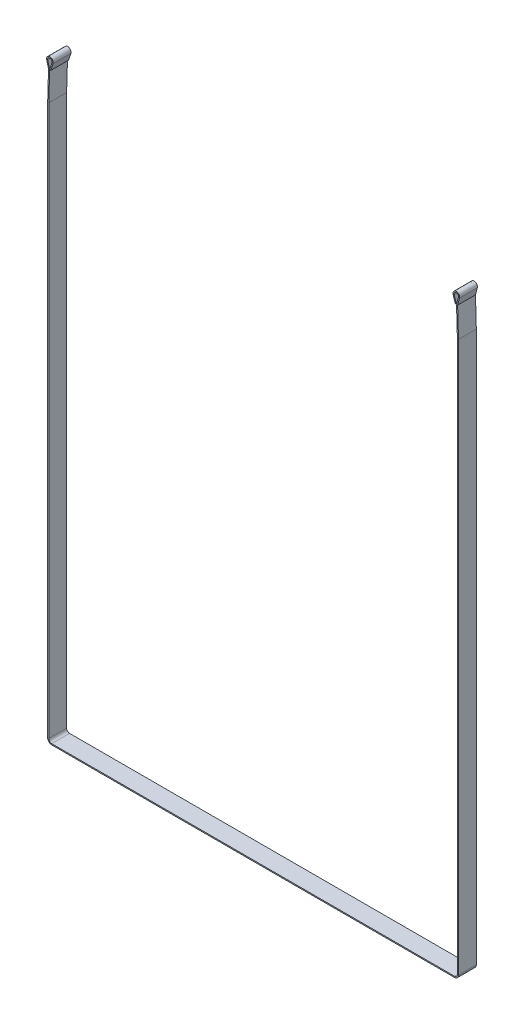
ISO-10303-21;
HEADER;
FILE_DESCRIPTION(('STEP AP214'),'2;1');
FILE_NAME('part.step','',(''),(''),'','','');
FILE_SCHEMA(('AUTOMOTIVE_DESIGN { 1 0 10303 214 1 1 1 1 }'));
ENDSEC;
DATA;
#1=APPLICATION_CONTEXT('core data for automotive mechanical design processes');
#2=APPLICATION_PROTOCOL_DEFINITION('international standard','automotive_design',2000,#1);
#3=PRODUCT_CONTEXT('',#1,'mechanical');
#4=PRODUCT('Part','Part','',(#3));
#5=PRODUCT_RELATED_PRODUCT_CATEGORY('part','',(#4));
#6=PRODUCT_DEFINITION_FORMATION('','',#4);
#7=PRODUCT_DEFINITION_CONTEXT('part definition',#1,'design');
#8=PRODUCT_DEFINITION('design','',#6,#7);
#9=PRODUCT_DEFINITION_SHAPE('','',#8);
#10=(LENGTH_UNIT() NAMED_UNIT(*) SI_UNIT(.MILLI.,.METRE.));
#11=(NAMED_UNIT(*) PLANE_ANGLE_UNIT() SI_UNIT($,.RADIAN.));
#12=(NAMED_UNIT(*) SI_UNIT($,.STERADIAN.) SOLID_ANGLE_UNIT());
#13=UNCERTAINTY_MEASURE_WITH_UNIT(LENGTH_MEASURE(1.E-05),#10,'distance_accuracy_value','');
#14=(GEOMETRIC_REPRESENTATION_CONTEXT(3) GLOBAL_UNCERTAINTY_ASSIGNED_CONTEXT((#13)) GLOBAL_UNIT_ASSIGNED_CONTEXT((#10,
#11,#12)) REPRESENTATION_CONTEXT('',''));
#15=CARTESIAN_POINT('',(0.,0.,0.));
#16=DIRECTION('',(0.,0.,1.));
#17=DIRECTION('',(1.,0.,0.));
#18=AXIS2_PLACEMENT_3D('',#15,#16,#17);
#19=CARTESIAN_POINT('',(538.452794867994,17.1812619079811,24.));
#20=DIRECTION('',(0.949689459111851,0.313193121335448,0.));
#21=DIRECTION('',(-0.313193121335448,0.949689459111851,0.));
#22=AXIS2_PLACEMENT_3D('',#19,#20,#21);
#23=PLANE('',#22);
#24=DIRECTION('',(0.313193121335448,-0.949689459111851,0.));
#25=VECTOR('',#24,1.);
#26=CARTESIAN_POINT('',(538.452794867994,17.1812619079811,-24.));
#27=LINE('',#26,#25);
#28=CARTESIAN_POINT('',(538.452794867994,17.1812619079811,-24.));
#29=VERTEX_POINT('',#28);
#30=CARTESIAN_POINT('',(544.716657294702,-1.81252727425592,-24.));
#31=VERTEX_POINT('',#30);
#32=EDGE_CURVE('E252',#29,#31,#27,.T.);
#33=ORIENTED_EDGE('',*,*,#32,.T.);
#34=DIRECTION('',(0.,0.,-1.));
#35=VECTOR('',#34,1.);
#36=CARTESIAN_POINT('',(544.716657294702,-1.81252727425592,24.));
#37=LINE('',#36,#35);
#38=CARTESIAN_POINT('',(544.716657294702,-1.81252727425592,24.));
#39=VERTEX_POINT('',#38);
#40=EDGE_CURVE('E11',#39,#31,#37,.T.);
#41=ORIENTED_EDGE('',*,*,#40,.F.);
#42=DIRECTION('',(0.313193121335448,-0.949689459111851,0.));
#43=VECTOR('',#42,1.);
#44=CARTESIAN_POINT('',(538.452794867994,17.1812619079811,24.));
#45=LINE('',#44,#43);
#46=CARTESIAN_POINT('',(538.452794867994,17.1812619079811,24.));
#47=VERTEX_POINT('',#46);
#48=EDGE_CURVE('E150',#47,#39,#45,.T.);
#49=ORIENTED_EDGE('',*,*,#48,.F.);
#50=DIRECTION('',(0.,0.,-1.));
#51=VECTOR('',#50,1.);
#52=CARTESIAN_POINT('',(538.452794867994,17.1812619079811,24.));
#53=LINE('',#52,#51);
#54=EDGE_CURVE('E248',#47,#29,#53,.T.);
#55=ORIENTED_EDGE('',*,*,#54,.T.);
#56=EDGE_LOOP('',(#33,#41,#49,#55));
#57=FACE_BOUND('',#56,.T.);
#58=ADVANCED_FACE('F36',(#57),#23,.F.);
#59=CARTESIAN_POINT('',(547.565725672038,-0.872947910249577,24.));
#60=DIRECTION('',(0.313193121335447,-0.949689459111851,0.));
#61=DIRECTION('',(0.949689459111851,0.313193121335447,0.));
#62=AXIS2_PLACEMENT_3D('',#59,#60,#61);
#63=PLANE('',#62);
#64=DIRECTION('',(-0.949689459111851,-0.313193121335447,0.));
#65=VECTOR('',#64,1.);
#66=CARTESIAN_POINT('',(547.565725672038,-0.872947910249577,-24.));
#67=LINE('',#66,#65);
#68=CARTESIAN_POINT('',(547.565725672038,-0.872947910249577,-24.));
#69=VERTEX_POINT('',#68);
#70=EDGE_CURVE('E255',#69,#31,#67,.T.);
#71=ORIENTED_EDGE('',*,*,#70,.F.);
#72=DIRECTION('',(0.,0.,-1.));
#73=VECTOR('',#72,1.);
#74=CARTESIAN_POINT('',(547.565725672038,-0.872947910249577,24.));
#75=LINE('',#74,#73);
#76=CARTESIAN_POINT('',(547.565725672038,-0.872947910249577,24.));
#77=VERTEX_POINT('',#76);
#78=EDGE_CURVE('E44',#77,#69,#75,.T.);
#79=ORIENTED_EDGE('',*,*,#78,.F.);
#80=DIRECTION('',(-0.949689459111851,-0.313193121335447,0.));
#81=VECTOR('',#80,1.);
#82=CARTESIAN_POINT('',(547.565725672038,-0.872947910249577,24.));
#83=LINE('',#82,#81);
#84=EDGE_CURVE('E396',#77,#39,#83,.T.);
#85=ORIENTED_EDGE('',*,*,#84,.T.);
#86=ORIENTED_EDGE('',*,*,#40,.T.);
#87=EDGE_LOOP('',(#71,#79,#85,#86));
#88=FACE_BOUND('',#87,.T.);
#89=ADVANCED_FACE('F386',(#88),#63,.T.);
#90=CARTESIAN_POINT('',(541.301863245329,18.1208412719874,24.));
#91=DIRECTION('',(0.949689459111851,0.313193121335448,0.));
#92=DIRECTION('',(-0.313193121335448,0.949689459111851,0.));
#93=AXIS2_PLACEMENT_3D('',#90,#91,#92);
#94=PLANE('',#93);
#95=DIRECTION('',(0.313193121335448,-0.949689459111851,0.));
#96=VECTOR('',#95,1.);
#97=CARTESIAN_POINT('',(541.301863245329,18.1208412719874,-24.));
#98=LINE('',#97,#96);
#99=CARTESIAN_POINT('',(541.301863245329,18.1208412719873,-24.));
#100=VERTEX_POINT('',#99);
#101=EDGE_CURVE('E258',#100,#69,#98,.T.);
#102=ORIENTED_EDGE('',*,*,#101,.F.);
#103=DIRECTION('',(0.,0.,-1.));
#104=VECTOR('',#103,1.);
#105=CARTESIAN_POINT('',(541.301863245329,18.1208412719873,24.));
#106=LINE('',#105,#104);
#107=CARTESIAN_POINT('',(541.301863245329,18.1208412719873,24.));
#108=VERTEX_POINT('',#107);
#109=EDGE_CURVE('E375',#108,#100,#106,.T.);
#110=ORIENTED_EDGE('',*,*,#109,.F.);
#111=DIRECTION('',(0.313193121335448,-0.949689459111851,0.));
#112=VECTOR('',#111,1.);
#113=CARTESIAN_POINT('',(541.301863245329,18.1208412719874,24.));
#114=LINE('',#113,#112);
#115=EDGE_CURVE('E383',#108,#77,#114,.T.);
#116=ORIENTED_EDGE('',*,*,#115,.T.);
#117=ORIENTED_EDGE('',*,*,#78,.T.);
#118=EDGE_LOOP('',(#102,#110,#116,#117));
#119=FACE_BOUND('',#118,.T.);
#120=ADVANCED_FACE('F381',(#119),#94,.T.);
#121=CARTESIAN_POINT('',(547.,20.0000000000002,24.));
#122=DIRECTION('',(0.,0.,-1.));
#123=DIRECTION('',(-1.,0.,0.));
#124=AXIS2_PLACEMENT_3D('',#121,#122,#123);
#125=CYLINDRICAL_SURFACE('',#124,6.00000000000006);
#126=CARTESIAN_POINT('',(547.,20.0000000000002,-24.));
#127=DIRECTION('',(0.,0.,1.));
#128=DIRECTION('',(1.,0.,0.));
#129=AXIS2_PLACEMENT_3D('',#126,#127,#128);
#130=CIRCLE('',#129,6.00000000000006);
#131=CARTESIAN_POINT('',(552.799001065501,18.4600043369173,-24.));
#132=VERTEX_POINT('',#131);
#133=EDGE_CURVE('E261',#132,#100,#130,.T.);
#134=ORIENTED_EDGE('',*,*,#133,.F.);
#135=DIRECTION('',(0.,0.,-1.));
#136=VECTOR('',#135,1.);
#137=CARTESIAN_POINT('',(552.799001065501,18.4600043369173,24.));
#138=LINE('',#137,#136);
#139=CARTESIAN_POINT('',(552.799001065501,18.4600043369173,24.));
#140=VERTEX_POINT('',#139);
#141=EDGE_CURVE('E373',#140,#132,#138,.T.);
#142=ORIENTED_EDGE('',*,*,#141,.F.);
#143=CARTESIAN_POINT('',(547.,20.0000000000002,24.));
#144=DIRECTION('',(0.,0.,1.));
#145=DIRECTION('',(-1.,0.,0.));
#146=AXIS2_PLACEMENT_3D('',#143,#144,#145);
#147=CIRCLE('',#146,5.99999999999987);
#148=EDGE_CURVE('E394',#140,#108,#147,.T.);
#149=ORIENTED_EDGE('',*,*,#148,.T.);
#150=ORIENTED_EDGE('',*,*,#109,.T.);
#151=EDGE_LOOP('',(#134,#142,#149,#150));
#152=FACE_BOUND('',#151,.T.);
#153=ADVANCED_FACE('F393',(#152),#125,.F.);
#154=CARTESIAN_POINT('',(552.799001065501,18.4600043369173,24.));
#155=DIRECTION('',(-0.966500177583562,0.25666594384714,0.));
#156=DIRECTION('',(-0.25666594384714,-0.966500177583562,0.));
#157=AXIS2_PLACEMENT_3D('',#154,#155,#156);
#158=PLANE('',#157);
#159=DIRECTION('',(0.25666594384714,0.966500177583562,0.));
#160=VECTOR('',#159,1.);
#161=CARTESIAN_POINT('',(552.799001065501,18.4600043369173,-24.));
#162=LINE('',#161,#160);
#163=CARTESIAN_POINT('',(547.665682188558,-0.869999214753968,-24.));
#164=VERTEX_POINT('',#163);
#165=EDGE_CURVE('E263',#164,#132,#162,.T.);
#166=ORIENTED_EDGE('',*,*,#165,.F.);
#167=DIRECTION('',(0.,0.,-1.));
#168=VECTOR('',#167,1.);
#169=CARTESIAN_POINT('',(547.665682188558,-0.869999214753968,24.));
#170=LINE('',#169,#168);
#171=CARTESIAN_POINT('',(547.665682188558,-0.869999214753968,24.));
#172=VERTEX_POINT('',#171);
#173=EDGE_CURVE('E371',#172,#164,#170,.T.);
#174=ORIENTED_EDGE('',*,*,#173,.F.);
#175=DIRECTION('',(0.25666594384714,0.966500177583562,0.));
#176=VECTOR('',#175,1.);
#177=CARTESIAN_POINT('',(552.799001065501,18.4600043369173,24.));
#178=LINE('',#177,#176);
#179=EDGE_CURVE('E398',#172,#140,#178,.T.);
#180=ORIENTED_EDGE('',*,*,#179,.T.);
#181=ORIENTED_EDGE('',*,*,#141,.T.);
#182=EDGE_LOOP('',(#166,#174,#180,#181));
#183=FACE_BOUND('',#182,.T.);
#184=ADVANCED_FACE('F476',(#183),#158,.T.);
#185=CARTESIAN_POINT('',(550.,-79.9999999999999,24.));
#186=DIRECTION('',(-0.999565165203058,-0.02948695495609,0.));
#187=DIRECTION('',(0.02948695495609,-0.999565165203059,0.));
#188=AXIS2_PLACEMENT_3D('',#185,#186,#187);
#189=PLANE('',#188);
#190=DIRECTION('',(-0.02948695495609,0.999565165203058,0.));
#191=VECTOR('',#190,1.);
#192=CARTESIAN_POINT('',(550.,-79.9999999999999,-24.));
#193=LINE('',#192,#191);
#194=CARTESIAN_POINT('',(550.,-79.9999999999999,-24.));
#195=VERTEX_POINT('',#194);
#196=EDGE_CURVE('E266',#195,#164,#193,.T.);
#197=ORIENTED_EDGE('',*,*,#196,.F.);
#198=DIRECTION('',(0.,0.,-1.));
#199=VECTOR('',#198,1.);
#200=CARTESIAN_POINT('',(550.,-79.9999999999999,24.));
#201=LINE('',#200,#199);
#202=CARTESIAN_POINT('',(550.,-79.9999999999999,24.));
#203=VERTEX_POINT('',#202);
#204=EDGE_CURVE('E369',#203,#195,#201,.T.);
#205=ORIENTED_EDGE('',*,*,#204,.F.);
#206=DIRECTION('',(-0.02948695495609,0.999565165203058,0.));
#207=VECTOR('',#206,1.);
#208=CARTESIAN_POINT('',(550.,-79.9999999999999,24.));
#209=LINE('',#208,#207);
#210=EDGE_CURVE('E405',#203,#172,#209,.T.);
#211=ORIENTED_EDGE('',*,*,#210,.T.);
#212=ORIENTED_EDGE('',*,*,#173,.T.);
#213=EDGE_LOOP('',(#197,#205,#211,#212));
#214=FACE_BOUND('',#213,.T.);
#215=ADVANCED_FACE('F479',(#214),#189,.T.);
#216=CARTESIAN_POINT('',(550.,-1562.,24.));
#217=DIRECTION('',(-1.,0.,0.));
#218=DIRECTION('',(0.,-1.,0.));
#219=AXIS2_PLACEMENT_3D('',#216,#217,#218);
#220=PLANE('',#219);
#221=DIRECTION('',(0.,1.,0.));
#222=VECTOR('',#221,1.);
#223=CARTESIAN_POINT('',(550.,-1562.,-24.));
#224=LINE('',#223,#222);
#225=CARTESIAN_POINT('',(550.,-1562.,-24.));
#226=VERTEX_POINT('',#225);
#227=EDGE_CURVE('E269',#226,#195,#224,.T.);
#228=ORIENTED_EDGE('',*,*,#227,.F.);
#229=DIRECTION('',(0.,0.,-1.));
#230=VECTOR('',#229,1.);
#231=CARTESIAN_POINT('',(550.,-1562.,24.));
#232=LINE('',#231,#230);
#233=CARTESIAN_POINT('',(550.,-1562.,24.));
#234=VERTEX_POINT('',#233);
#235=EDGE_CURVE('E367',#234,#226,#232,.T.);
#236=ORIENTED_EDGE('',*,*,#235,.F.);
#237=DIRECTION('',(0.,1.,0.));
#238=VECTOR('',#237,1.);
#239=CARTESIAN_POINT('',(550.,-1562.,24.));
#240=LINE('',#239,#238);
#241=EDGE_CURVE('E408',#234,#203,#240,.T.);
#242=ORIENTED_EDGE('',*,*,#241,.T.);
#243=ORIENTED_EDGE('',*,*,#204,.T.);
#244=EDGE_LOOP('',(#228,#236,#242,#243));
#245=FACE_BOUND('',#244,.T.);
#246=ADVANCED_FACE('F483',(#245),#220,.T.);
#247=CARTESIAN_POINT('',(542.,-1562.,24.));
#248=DIRECTION('',(0.,0.,-1.));
#249=DIRECTION('',(-1.,0.,0.));
#250=AXIS2_PLACEMENT_3D('',#247,#248,#249);
#251=CYLINDRICAL_SURFACE('',#250,7.9999999999999);
#252=CARTESIAN_POINT('',(542.,-1562.,-24.));
#253=DIRECTION('',(0.,0.,1.));
#254=DIRECTION('',(-1.,0.,0.));
#255=AXIS2_PLACEMENT_3D('',#252,#253,#254);
#256=CIRCLE('',#255,7.9999999999999);
#257=CARTESIAN_POINT('',(542.,-1570.,-24.));
#258=VERTEX_POINT('',#257);
#259=EDGE_CURVE('E272',#258,#226,#256,.T.);
#260=ORIENTED_EDGE('',*,*,#259,.F.);
#261=DIRECTION('',(0.,0.,-1.));
#262=VECTOR('',#261,1.);
#263=CARTESIAN_POINT('',(542.,-1570.,24.));
#264=LINE('',#263,#262);
#265=CARTESIAN_POINT('',(542.,-1570.,24.));
#266=VERTEX_POINT('',#265);
#267=EDGE_CURVE('E365',#266,#258,#264,.T.);
#268=ORIENTED_EDGE('',*,*,#267,.F.);
#269=CARTESIAN_POINT('',(542.,-1562.,24.));
#270=DIRECTION('',(0.,0.,1.));
#271=DIRECTION('',(-1.,0.,0.));
#272=AXIS2_PLACEMENT_3D('',#269,#270,#271);
#273=CIRCLE('',#272,7.9999999999999);
#274=EDGE_CURVE('E411',#266,#234,#273,.T.);
#275=ORIENTED_EDGE('',*,*,#274,.T.);
#276=ORIENTED_EDGE('',*,*,#235,.T.);
#277=EDGE_LOOP('',(#260,#268,#275,#276));
#278=FACE_BOUND('',#277,.T.);
#279=ADVANCED_FACE('F487',(#278),#251,.F.);
#280=CARTESIAN_POINT('',(542.,-1570.,24.));
#281=DIRECTION('',(0.,1.,0.));
#282=DIRECTION('',(-1.,0.,0.));
#283=AXIS2_PLACEMENT_3D('',#280,#281,#282);
#284=PLANE('',#283);
#285=DIRECTION('',(1.,0.,0.));
#286=VECTOR('',#285,1.);
#287=CARTESIAN_POINT('',(542.,-1570.,-24.));
#288=LINE('',#287,#286);
#289=CARTESIAN_POINT('',(-542.,-1570.,-24.));
#290=VERTEX_POINT('',#289);
#291=EDGE_CURVE('E275',#290,#258,#288,.T.);
#292=ORIENTED_EDGE('',*,*,#291,.F.);
#293=DIRECTION('',(0.,0.,-1.));
#294=VECTOR('',#293,1.);
#295=CARTESIAN_POINT('',(-542.,-1570.,24.));
#296=LINE('',#295,#294);
#297=CARTESIAN_POINT('',(-542.,-1570.,24.));
#298=VERTEX_POINT('',#297);
#299=EDGE_CURVE('E363',#298,#290,#296,.T.);
#300=ORIENTED_EDGE('',*,*,#299,.F.);
#301=DIRECTION('',(1.,0.,0.));
#302=VECTOR('',#301,1.);
#303=CARTESIAN_POINT('',(542.,-1570.,24.));
#304=LINE('',#303,#302);
#305=EDGE_CURVE('E414',#298,#266,#304,.T.);
#306=ORIENTED_EDGE('',*,*,#305,.T.);
#307=ORIENTED_EDGE('',*,*,#267,.T.);
#308=EDGE_LOOP('',(#292,#300,#306,#307));
#309=FACE_BOUND('',#308,.T.);
#310=ADVANCED_FACE('F491',(#309),#284,.T.);
#311=CARTESIAN_POINT('',(-542.,-1562.,24.));
#312=DIRECTION('',(0.,0.,-1.));
#313=DIRECTION('',(-1.,0.,0.));
#314=AXIS2_PLACEMENT_3D('',#311,#312,#313);
#315=CYLINDRICAL_SURFACE('',#314,7.9999999999999);
#316=CARTESIAN_POINT('',(-542.,-1562.,-24.));
#317=DIRECTION('',(0.,0.,1.));
#318=DIRECTION('',(1.,0.,0.));
#319=AXIS2_PLACEMENT_3D('',#316,#317,#318);
#320=CIRCLE('',#319,7.9999999999999);
#321=CARTESIAN_POINT('',(-550.,-1562.,-24.));
#322=VERTEX_POINT('',#321);
#323=EDGE_CURVE('E278',#322,#290,#320,.T.);
#324=ORIENTED_EDGE('',*,*,#323,.F.);
#325=DIRECTION('',(0.,0.,-1.));
#326=VECTOR('',#325,1.);
#327=CARTESIAN_POINT('',(-550.,-1562.,24.));
#328=LINE('',#327,#326);
#329=CARTESIAN_POINT('',(-550.,-1562.,24.));
#330=VERTEX_POINT('',#329);
#331=EDGE_CURVE('E361',#330,#322,#328,.T.);
#332=ORIENTED_EDGE('',*,*,#331,.F.);
#333=CARTESIAN_POINT('',(-542.,-1562.,24.));
#334=DIRECTION('',(0.,0.,1.));
#335=DIRECTION('',(1.,0.,0.));
#336=AXIS2_PLACEMENT_3D('',#333,#334,#335);
#337=CIRCLE('',#336,7.9999999999999);
#338=EDGE_CURVE('E417',#330,#298,#337,.T.);
#339=ORIENTED_EDGE('',*,*,#338,.T.);
#340=ORIENTED_EDGE('',*,*,#299,.T.);
#341=EDGE_LOOP('',(#324,#332,#339,#340));
#342=FACE_BOUND('',#341,.T.);
#343=ADVANCED_FACE('F495',(#342),#315,.F.);
#344=CARTESIAN_POINT('',(-550.,-1562.,24.));
#345=DIRECTION('',(1.,0.,0.));
#346=DIRECTION('',(0.,1.,0.));
#347=AXIS2_PLACEMENT_3D('',#344,#345,#346);
#348=PLANE('',#347);
#349=DIRECTION('',(0.,-1.,0.));
#350=VECTOR('',#349,1.);
#351=CARTESIAN_POINT('',(-550.,-1562.,-24.));
#352=LINE('',#351,#350);
#353=CARTESIAN_POINT('',(-550.,-80.,-24.));
#354=VERTEX_POINT('',#353);
#355=EDGE_CURVE('E281',#354,#322,#352,.T.);
#356=ORIENTED_EDGE('',*,*,#355,.F.);
#357=DIRECTION('',(0.,0.,-1.));
#358=VECTOR('',#357,1.);
#359=CARTESIAN_POINT('',(-550.,-80.,24.));
#360=LINE('',#359,#358);
#361=CARTESIAN_POINT('',(-550.,-80.,24.));
#362=VERTEX_POINT('',#361);
#363=EDGE_CURVE('E359',#362,#354,#360,.T.);
#364=ORIENTED_EDGE('',*,*,#363,.F.);
#365=DIRECTION('',(0.,-1.,0.));
#366=VECTOR('',#365,1.);
#367=CARTESIAN_POINT('',(-550.,-1562.,24.));
#368=LINE('',#367,#366);
#369=EDGE_CURVE('E420',#362,#330,#368,.T.);
#370=ORIENTED_EDGE('',*,*,#369,.T.);
#371=ORIENTED_EDGE('',*,*,#331,.T.);
#372=EDGE_LOOP('',(#356,#364,#370,#371));
#373=FACE_BOUND('',#372,.T.);
#374=ADVANCED_FACE('F499',(#373),#348,.T.);
#375=CARTESIAN_POINT('',(-550.,-80.,24.));
#376=DIRECTION('',(0.999565165203058,-0.02948695495609,0.));
#377=DIRECTION('',(0.02948695495609,0.999565165203059,0.));
#378=AXIS2_PLACEMENT_3D('',#375,#376,#377);
#379=PLANE('',#378);
#380=DIRECTION('',(-0.02948695495609,-0.999565165203058,0.));
#381=VECTOR('',#380,1.);
#382=CARTESIAN_POINT('',(-550.,-80.,-24.));
#383=LINE('',#382,#381);
#384=CARTESIAN_POINT('',(-547.665682188558,-0.869999214754103,-24.));
#385=VERTEX_POINT('',#384);
#386=EDGE_CURVE('E284',#385,#354,#383,.T.);
#387=ORIENTED_EDGE('',*,*,#386,.F.);
#388=DIRECTION('',(0.,0.,-1.));
#389=VECTOR('',#388,1.);
#390=CARTESIAN_POINT('',(-547.665682188558,-0.869999214754103,24.));
#391=LINE('',#390,#389);
#392=CARTESIAN_POINT('',(-547.665682188558,-0.869999214754103,24.));
#393=VERTEX_POINT('',#392);
#394=EDGE_CURVE('E357',#393,#385,#391,.T.);
#395=ORIENTED_EDGE('',*,*,#394,.F.);
#396=DIRECTION('',(-0.02948695495609,-0.999565165203058,0.));
#397=VECTOR('',#396,1.);
#398=CARTESIAN_POINT('',(-550.,-80.,24.));
#399=LINE('',#398,#397);
#400=EDGE_CURVE('E423',#393,#362,#399,.T.);
#401=ORIENTED_EDGE('',*,*,#400,.T.);
#402=ORIENTED_EDGE('',*,*,#363,.T.);
#403=EDGE_LOOP('',(#387,#395,#401,#402));
#404=FACE_BOUND('',#403,.T.);
#405=ADVANCED_FACE('F503',(#404),#379,.T.);
#406=CARTESIAN_POINT('',(-552.799001065501,18.4600043369171,24.));
#407=DIRECTION('',(0.966500177583562,0.25666594384714,0.));
#408=DIRECTION('',(-0.25666594384714,0.966500177583562,0.));
#409=AXIS2_PLACEMENT_3D('',#406,#407,#408);
#410=PLANE('',#409);
#411=DIRECTION('',(0.25666594384714,-0.966500177583562,0.));
#412=VECTOR('',#411,1.);
#413=CARTESIAN_POINT('',(-552.799001065501,18.4600043369171,-24.));
#414=LINE('',#413,#412);
#415=CARTESIAN_POINT('',(-552.799001065501,18.4600043369171,-24.));
#416=VERTEX_POINT('',#415);
#417=EDGE_CURVE('E287',#416,#385,#414,.T.);
#418=ORIENTED_EDGE('',*,*,#417,.F.);
#419=DIRECTION('',(0.,0.,-1.));
#420=VECTOR('',#419,1.);
#421=CARTESIAN_POINT('',(-552.799001065501,18.4600043369171,24.));
#422=LINE('',#421,#420);
#423=CARTESIAN_POINT('',(-552.799001065501,18.4600043369171,24.));
#424=VERTEX_POINT('',#423);
#425=EDGE_CURVE('E354',#424,#416,#422,.T.);
#426=ORIENTED_EDGE('',*,*,#425,.F.);
#427=DIRECTION('',(0.25666594384714,-0.966500177583562,0.));
#428=VECTOR('',#427,1.);
#429=CARTESIAN_POINT('',(-552.799001065501,18.4600043369171,24.));
#430=LINE('',#429,#428);
#431=EDGE_CURVE('E426',#424,#393,#430,.T.);
#432=ORIENTED_EDGE('',*,*,#431,.T.);
#433=ORIENTED_EDGE('',*,*,#394,.T.);
#434=EDGE_LOOP('',(#418,#426,#432,#433));
#435=FACE_BOUND('',#434,.T.);
#436=ADVANCED_FACE('F507',(#435),#410,.T.);
#437=CARTESIAN_POINT('',(-547.,20.,24.));
#438=DIRECTION('',(0.,0.,-1.));
#439=DIRECTION('',(-1.,0.,0.));
#440=AXIS2_PLACEMENT_3D('',#437,#438,#439);
#441=CYLINDRICAL_SURFACE('',#440,5.99999999999987);
#442=CARTESIAN_POINT('',(-547.,20.,-24.));
#443=DIRECTION('',(0.,0.,1.));
#444=DIRECTION('',(1.,0.,0.));
#445=AXIS2_PLACEMENT_3D('',#442,#443,#444);
#446=CIRCLE('',#445,5.99999999999987);
#447=CARTESIAN_POINT('',(-541.301863245329,18.1208412719873,-24.));
#448=VERTEX_POINT('',#447);
#449=EDGE_CURVE('E290',#448,#416,#446,.T.);
#450=ORIENTED_EDGE('',*,*,#449,.F.);
#451=DIRECTION('',(0.,0.,-1.));
#452=VECTOR('',#451,1.);
#453=CARTESIAN_POINT('',(-541.301863245329,18.1208412719873,24.));
#454=LINE('',#453,#452);
#455=CARTESIAN_POINT('',(-541.301863245329,18.1208412719873,24.));
#456=VERTEX_POINT('',#455);
#457=EDGE_CURVE('E352',#456,#448,#454,.T.);
#458=ORIENTED_EDGE('',*,*,#457,.F.);
#459=CARTESIAN_POINT('',(-547.,20.,24.));
#460=DIRECTION('',(0.,0.,1.));
#461=DIRECTION('',(-1.,0.,0.));
#462=AXIS2_PLACEMENT_3D('',#459,#460,#461);
#463=CIRCLE('',#462,6.00000000000006);
#464=EDGE_CURVE('E429',#456,#424,#463,.T.);
#465=ORIENTED_EDGE('',*,*,#464,.T.);
#466=ORIENTED_EDGE('',*,*,#425,.T.);
#467=EDGE_LOOP('',(#450,#458,#465,#466));
#468=FACE_BOUND('',#467,.T.);
#469=ADVANCED_FACE('F511',(#468),#441,.F.);
#470=CARTESIAN_POINT('',(-541.301863245329,18.1208412719873,24.));
#471=DIRECTION('',(-0.949689459111851,0.313193121335448,0.));
#472=DIRECTION('',(-0.313193121335448,-0.949689459111851,0.));
#473=AXIS2_PLACEMENT_3D('',#470,#471,#472);
#474=PLANE('',#473);
#475=DIRECTION('',(0.313193121335448,0.949689459111851,0.));
#476=VECTOR('',#475,1.);
#477=CARTESIAN_POINT('',(-541.301863245329,18.1208412719873,-24.));
#478=LINE('',#477,#476);
#479=CARTESIAN_POINT('',(-547.565725672038,-0.872947910249711,-24.));
#480=VERTEX_POINT('',#479);
#481=EDGE_CURVE('E292',#480,#448,#478,.T.);
#482=ORIENTED_EDGE('',*,*,#481,.F.);
#483=DIRECTION('',(0.,0.,-1.));
#484=VECTOR('',#483,1.);
#485=CARTESIAN_POINT('',(-547.565725672038,-0.872947910249711,24.));
#486=LINE('',#485,#484);
#487=CARTESIAN_POINT('',(-547.565725672038,-0.872947910249711,24.));
#488=VERTEX_POINT('',#487);
#489=EDGE_CURVE('E350',#488,#480,#486,.T.);
#490=ORIENTED_EDGE('',*,*,#489,.F.);
#491=DIRECTION('',(0.313193121335448,0.949689459111851,0.));
#492=VECTOR('',#491,1.);
#493=CARTESIAN_POINT('',(-541.301863245329,18.1208412719873,24.));
#494=LINE('',#493,#492);
#495=EDGE_CURVE('E432',#488,#456,#494,.T.);
#496=ORIENTED_EDGE('',*,*,#495,.T.);
#497=ORIENTED_EDGE('',*,*,#457,.T.);
#498=EDGE_LOOP('',(#482,#490,#496,#497));
#499=FACE_BOUND('',#498,.T.);
#500=ADVANCED_FACE('F515',(#499),#474,.T.);
#501=CARTESIAN_POINT('',(-544.716657294702,-1.81252727425606,24.));
#502=DIRECTION('',(-0.313193121335448,-0.949689459111851,0.));
#503=DIRECTION('',(0.949689459111851,-0.313193121335448,0.));
#504=AXIS2_PLACEMENT_3D('',#501,#502,#503);
#505=PLANE('',#504);
#506=DIRECTION('',(-0.949689459111851,0.313193121335448,0.));
#507=VECTOR('',#506,1.);
#508=CARTESIAN_POINT('',(-544.716657294702,-1.81252727425606,-24.));
#509=LINE('',#508,#507);
#510=CARTESIAN_POINT('',(-544.716657294702,-1.81252727425606,-24.));
#511=VERTEX_POINT('',#510);
#512=EDGE_CURVE('E295',#511,#480,#509,.T.);
#513=ORIENTED_EDGE('',*,*,#512,.F.);
#514=DIRECTION('',(0.,0.,-1.));
#515=VECTOR('',#514,1.);
#516=CARTESIAN_POINT('',(-544.716657294702,-1.81252727425606,24.));
#517=LINE('',#516,#515);
#518=CARTESIAN_POINT('',(-544.716657294702,-1.81252727425606,24.));
#519=VERTEX_POINT('',#518);
#520=EDGE_CURVE('E348',#519,#511,#517,.T.);
#521=ORIENTED_EDGE('',*,*,#520,.F.);
#522=DIRECTION('',(-0.949689459111851,0.313193121335448,0.));
#523=VECTOR('',#522,1.);
#524=CARTESIAN_POINT('',(-544.716657294702,-1.81252727425606,24.));
#525=LINE('',#524,#523);
#526=EDGE_CURVE('E435',#519,#488,#525,.T.);
#527=ORIENTED_EDGE('',*,*,#526,.T.);
#528=ORIENTED_EDGE('',*,*,#489,.T.);
#529=EDGE_LOOP('',(#513,#521,#527,#528));
#530=FACE_BOUND('',#529,.T.);
#531=ADVANCED_FACE('F519',(#530),#505,.T.);
#532=CARTESIAN_POINT('',(-538.452794867994,17.181261907981,24.));
#533=DIRECTION('',(-0.949689459111851,0.313193121335448,0.));
#534=DIRECTION('',(-0.313193121335448,-0.949689459111851,0.));
#535=AXIS2_PLACEMENT_3D('',#532,#533,#534);
#536=PLANE('',#535);
#537=DIRECTION('',(0.313193121335448,0.949689459111851,0.));
#538=VECTOR('',#537,1.);
#539=CARTESIAN_POINT('',(-538.452794867994,17.181261907981,-24.));
#540=LINE('',#539,#538);
#541=CARTESIAN_POINT('',(-538.452794867993,17.1812619079808,-24.));
#542=VERTEX_POINT('',#541);
#543=EDGE_CURVE('E298',#511,#542,#540,.T.);
#544=ORIENTED_EDGE('',*,*,#543,.T.);
#545=DIRECTION('',(0.,0.,-1.));
#546=VECTOR('',#545,1.);
#547=CARTESIAN_POINT('',(-538.452794867993,17.1812619079808,24.));
#548=LINE('',#547,#546);
#549=CARTESIAN_POINT('',(-538.452794867993,17.1812619079808,24.));
#550=VERTEX_POINT('',#549);
#551=EDGE_CURVE('E345',#550,#542,#548,.T.);
#552=ORIENTED_EDGE('',*,*,#551,.F.);
#553=DIRECTION('',(0.313193121335448,0.949689459111851,0.));
#554=VECTOR('',#553,1.);
#555=CARTESIAN_POINT('',(-538.452794867994,17.181261907981,24.));
#556=LINE('',#555,#554);
#557=EDGE_CURVE('E438',#519,#550,#556,.T.);
#558=ORIENTED_EDGE('',*,*,#557,.F.);
#559=ORIENTED_EDGE('',*,*,#520,.T.);
#560=EDGE_LOOP('',(#544,#552,#558,#559));
#561=FACE_BOUND('',#560,.T.);
#562=ADVANCED_FACE('F523',(#561),#536,.F.);
#563=CARTESIAN_POINT('',(-547.,20.,24.));
#564=DIRECTION('',(0.,0.,-1.));
#565=DIRECTION('',(-1.,0.,0.));
#566=AXIS2_PLACEMENT_3D('',#563,#564,#565);
#567=CYLINDRICAL_SURFACE('',#566,9.00000000000006);
#568=CARTESIAN_POINT('',(-547.,20.,-24.));
#569=DIRECTION('',(0.,0.,1.));
#570=DIRECTION('',(1.,0.,0.));
#571=AXIS2_PLACEMENT_3D('',#568,#569,#570);
#572=CIRCLE('',#571,9.00000000000006);
#573=CARTESIAN_POINT('',(-555.698501598252,17.6900065053757,-24.));
#574=VERTEX_POINT('',#573);
#575=EDGE_CURVE('E301',#542,#574,#572,.T.);
#576=ORIENTED_EDGE('',*,*,#575,.T.);
#577=DIRECTION('',(0.,0.,-1.));
#578=VECTOR('',#577,1.);
#579=CARTESIAN_POINT('',(-555.698501598252,17.6900065053757,24.));
#580=LINE('',#579,#578);
#581=CARTESIAN_POINT('',(-555.698501598252,17.6900065053757,24.));
#582=VERTEX_POINT('',#581);
#583=EDGE_CURVE('E342',#582,#574,#580,.T.);
#584=ORIENTED_EDGE('',*,*,#583,.F.);
#585=CARTESIAN_POINT('',(-547.,20.,24.));
#586=DIRECTION('',(0.,0.,1.));
#587=DIRECTION('',(1.,0.,0.));
#588=AXIS2_PLACEMENT_3D('',#585,#586,#587);
#589=CIRCLE('',#588,8.99999999999987);
#590=EDGE_CURVE('E440',#550,#582,#589,.T.);
#591=ORIENTED_EDGE('',*,*,#590,.F.);
#592=ORIENTED_EDGE('',*,*,#551,.T.);
#593=EDGE_LOOP('',(#576,#584,#591,#592));
#594=FACE_BOUND('',#593,.T.);
#595=ADVANCED_FACE('F527',(#594),#567,.T.);
#596=CARTESIAN_POINT('',(-555.698501598252,17.6900065053757,24.));
#597=DIRECTION('',(0.966500177583562,0.25666594384714,0.));
#598=DIRECTION('',(-0.25666594384714,0.966500177583562,0.));
#599=AXIS2_PLACEMENT_3D('',#596,#597,#598);
#600=PLANE('',#599);
#601=DIRECTION('',(0.25666594384714,-0.966500177583562,0.));
#602=VECTOR('',#601,1.);
#603=CARTESIAN_POINT('',(-555.698501598252,17.6900065053757,-24.));
#604=LINE('',#603,#602);
#605=CARTESIAN_POINT('',(-550.677252807065,-1.21798641192253,-24.));
#606=VERTEX_POINT('',#605);
#607=EDGE_CURVE('E303',#574,#606,#604,.T.);
#608=ORIENTED_EDGE('',*,*,#607,.T.);
#609=DIRECTION('',(0.,0.,-1.));
#610=VECTOR('',#609,1.);
#611=CARTESIAN_POINT('',(-550.677252807065,-1.21798641192253,24.));
#612=LINE('',#611,#610);
#613=CARTESIAN_POINT('',(-550.677252807065,-1.21798641192253,24.));
#614=VERTEX_POINT('',#613);
#615=EDGE_CURVE('E339',#614,#606,#612,.T.);
#616=ORIENTED_EDGE('',*,*,#615,.F.);
#617=DIRECTION('',(0.25666594384714,-0.966500177583562,0.));
#618=VECTOR('',#617,1.);
#619=CARTESIAN_POINT('',(-555.698501598252,17.6900065053757,24.));
#620=LINE('',#619,#618);
#621=EDGE_CURVE('E442',#582,#614,#620,.T.);
#622=ORIENTED_EDGE('',*,*,#621,.F.);
#623=ORIENTED_EDGE('',*,*,#583,.T.);
#624=EDGE_LOOP('',(#608,#616,#622,#623));
#625=FACE_BOUND('',#624,.T.);
#626=ADVANCED_FACE('F531',(#625),#600,.F.);
#627=CARTESIAN_POINT('',(-552.998695495609,-79.9115391351317,24.));
#628=DIRECTION('',(0.999565165203058,-0.02948695495609,0.));
#629=DIRECTION('',(0.02948695495609,0.999565165203059,0.));
#630=AXIS2_PLACEMENT_3D('',#627,#628,#629);
#631=PLANE('',#630);
#632=DIRECTION('',(-0.02948695495609,-0.999565165203059,0.));
#633=VECTOR('',#632,1.);
#634=CARTESIAN_POINT('',(-552.998695495609,-79.9115391351317,-24.));
#635=LINE('',#634,#633);
#636=CARTESIAN_POINT('',(-553.,-79.9557599490097,-24.));
#637=VERTEX_POINT('',#636);
#638=EDGE_CURVE('E305',#606,#637,#635,.T.);
#639=ORIENTED_EDGE('',*,*,#638,.T.);
#640=DIRECTION('',(0.,0.,-1.));
#641=VECTOR('',#640,1.);
#642=CARTESIAN_POINT('',(-553.,-79.9557599490097,24.));
#643=LINE('',#642,#641);
#644=CARTESIAN_POINT('',(-553.,-79.9557599490097,24.));
#645=VERTEX_POINT('',#644);
#646=EDGE_CURVE('E336',#645,#637,#643,.T.);
#647=ORIENTED_EDGE('',*,*,#646,.F.);
#648=DIRECTION('',(-0.02948695495609,-0.999565165203059,0.));
#649=VECTOR('',#648,1.);
#650=CARTESIAN_POINT('',(-552.998695495609,-79.9115391351317,24.));
#651=LINE('',#650,#649);
#652=EDGE_CURVE('E444',#614,#645,#651,.T.);
#653=ORIENTED_EDGE('',*,*,#652,.F.);
#654=ORIENTED_EDGE('',*,*,#615,.T.);
#655=EDGE_LOOP('',(#639,#647,#653,#654));
#656=FACE_BOUND('',#655,.T.);
#657=ADVANCED_FACE('F535',(#656),#631,.F.);
#658=CARTESIAN_POINT('',(-553.,-1562.,24.));
#659=DIRECTION('',(1.,0.,0.));
#660=DIRECTION('',(0.,1.,0.));
#661=AXIS2_PLACEMENT_3D('',#658,#659,#660);
#662=PLANE('',#661);
#663=DIRECTION('',(0.,-1.,0.));
#664=VECTOR('',#663,1.);
#665=CARTESIAN_POINT('',(-553.,-1562.,-24.));
#666=LINE('',#665,#664);
#667=CARTESIAN_POINT('',(-553.,-1562.,-24.));
#668=VERTEX_POINT('',#667);
#669=EDGE_CURVE('E307',#637,#668,#666,.T.);
#670=ORIENTED_EDGE('',*,*,#669,.T.);
#671=DIRECTION('',(0.,0.,-1.));
#672=VECTOR('',#671,1.);
#673=CARTESIAN_POINT('',(-553.,-1562.,24.));
#674=LINE('',#673,#672);
#675=CARTESIAN_POINT('',(-553.,-1562.,24.));
#676=VERTEX_POINT('',#675);
#677=EDGE_CURVE('E333',#676,#668,#674,.T.);
#678=ORIENTED_EDGE('',*,*,#677,.F.);
#679=DIRECTION('',(0.,-1.,0.));
#680=VECTOR('',#679,1.);
#681=CARTESIAN_POINT('',(-553.,-1562.,24.));
#682=LINE('',#681,#680);
#683=EDGE_CURVE('E446',#645,#676,#682,.T.);
#684=ORIENTED_EDGE('',*,*,#683,.F.);
#685=ORIENTED_EDGE('',*,*,#646,.T.);
#686=EDGE_LOOP('',(#670,#678,#684,#685));
#687=FACE_BOUND('',#686,.T.);
#688=ADVANCED_FACE('F539',(#687),#662,.F.);
#689=CARTESIAN_POINT('',(-542.,-1562.,24.));
#690=DIRECTION('',(0.,0.,-1.));
#691=DIRECTION('',(-1.,0.,0.));
#692=AXIS2_PLACEMENT_3D('',#689,#690,#691);
#693=CYLINDRICAL_SURFACE('',#692,10.9999999999999);
#694=CARTESIAN_POINT('',(-542.,-1562.,-24.));
#695=DIRECTION('',(0.,0.,1.));
#696=DIRECTION('',(1.,0.,0.));
#697=AXIS2_PLACEMENT_3D('',#694,#695,#696);
#698=CIRCLE('',#697,10.9999999999999);
#699=CARTESIAN_POINT('',(-542.,-1573.,-24.));
#700=VERTEX_POINT('',#699);
#701=EDGE_CURVE('E309',#668,#700,#698,.T.);
#702=ORIENTED_EDGE('',*,*,#701,.T.);
#703=DIRECTION('',(0.,0.,-1.));
#704=VECTOR('',#703,1.);
#705=CARTESIAN_POINT('',(-542.,-1573.,24.));
#706=LINE('',#705,#704);
#707=CARTESIAN_POINT('',(-542.,-1573.,24.));
#708=VERTEX_POINT('',#707);
#709=EDGE_CURVE('E330',#708,#700,#706,.T.);
#710=ORIENTED_EDGE('',*,*,#709,.F.);
#711=CARTESIAN_POINT('',(-542.,-1562.,24.));
#712=DIRECTION('',(0.,0.,1.));
#713=DIRECTION('',(1.,0.,0.));
#714=AXIS2_PLACEMENT_3D('',#711,#712,#713);
#715=CIRCLE('',#714,10.9999999999999);
#716=EDGE_CURVE('E448',#676,#708,#715,.T.);
#717=ORIENTED_EDGE('',*,*,#716,.F.);
#718=ORIENTED_EDGE('',*,*,#677,.T.);
#719=EDGE_LOOP('',(#702,#710,#717,#718));
#720=FACE_BOUND('',#719,.T.);
#721=ADVANCED_FACE('F543',(#720),#693,.T.);
#722=CARTESIAN_POINT('',(542.,-1573.,24.));
#723=DIRECTION('',(0.,1.,0.));
#724=DIRECTION('',(-1.,0.,0.));
#725=AXIS2_PLACEMENT_3D('',#722,#723,#724);
#726=PLANE('',#725);
#727=DIRECTION('',(1.,0.,0.));
#728=VECTOR('',#727,1.);
#729=CARTESIAN_POINT('',(542.,-1573.,-24.));
#730=LINE('',#729,#728);
#731=CARTESIAN_POINT('',(542.,-1573.,-24.));
#732=VERTEX_POINT('',#731);
#733=EDGE_CURVE('E311',#700,#732,#730,.T.);
#734=ORIENTED_EDGE('',*,*,#733,.T.);
#735=DIRECTION('',(0.,0.,-1.));
#736=VECTOR('',#735,1.);
#737=CARTESIAN_POINT('',(542.,-1573.,24.));
#738=LINE('',#737,#736);
#739=CARTESIAN_POINT('',(542.,-1573.,24.));
#740=VERTEX_POINT('',#739);
#741=EDGE_CURVE('E327',#740,#732,#738,.T.);
#742=ORIENTED_EDGE('',*,*,#741,.F.);
#743=DIRECTION('',(1.,0.,0.));
#744=VECTOR('',#743,1.);
#745=CARTESIAN_POINT('',(542.,-1573.,24.));
#746=LINE('',#745,#744);
#747=EDGE_CURVE('E450',#708,#740,#746,.T.);
#748=ORIENTED_EDGE('',*,*,#747,.F.);
#749=ORIENTED_EDGE('',*,*,#709,.T.);
#750=EDGE_LOOP('',(#734,#742,#748,#749));
#751=FACE_BOUND('',#750,.T.);
#752=ADVANCED_FACE('F547',(#751),#726,.F.);
#753=CARTESIAN_POINT('',(542.,-1562.,24.));
#754=DIRECTION('',(0.,0.,-1.));
#755=DIRECTION('',(-1.,0.,0.));
#756=AXIS2_PLACEMENT_3D('',#753,#754,#755);
#757=CYLINDRICAL_SURFACE('',#756,10.9999999999999);
#758=CARTESIAN_POINT('',(542.,-1562.,-24.));
#759=DIRECTION('',(0.,0.,1.));
#760=DIRECTION('',(1.,0.,0.));
#761=AXIS2_PLACEMENT_3D('',#758,#759,#760);
#762=CIRCLE('',#761,10.9999999999999);
#763=CARTESIAN_POINT('',(553.,-1562.,-24.));
#764=VERTEX_POINT('',#763);
#765=EDGE_CURVE('E313',#732,#764,#762,.T.);
#766=ORIENTED_EDGE('',*,*,#765,.T.);
#767=DIRECTION('',(0.,0.,-1.));
#768=VECTOR('',#767,1.);
#769=CARTESIAN_POINT('',(553.,-1562.,24.));
#770=LINE('',#769,#768);
#771=CARTESIAN_POINT('',(553.,-1562.,24.));
#772=VERTEX_POINT('',#771);
#773=EDGE_CURVE('E324',#772,#764,#770,.T.);
#774=ORIENTED_EDGE('',*,*,#773,.F.);
#775=CARTESIAN_POINT('',(542.,-1562.,24.));
#776=DIRECTION('',(0.,0.,1.));
#777=DIRECTION('',(1.,0.,0.));
#778=AXIS2_PLACEMENT_3D('',#775,#776,#777);
#779=CIRCLE('',#778,10.9999999999999);
#780=EDGE_CURVE('E452',#740,#772,#779,.T.);
#781=ORIENTED_EDGE('',*,*,#780,.F.);
#782=ORIENTED_EDGE('',*,*,#741,.T.);
#783=EDGE_LOOP('',(#766,#774,#781,#782));
#784=FACE_BOUND('',#783,.T.);
#785=ADVANCED_FACE('F458',(#784),#757,.T.);
#786=CARTESIAN_POINT('',(553.,-1562.,24.));
#787=DIRECTION('',(-1.,0.,0.));
#788=DIRECTION('',(0.,-1.,0.));
#789=AXIS2_PLACEMENT_3D('',#786,#787,#788);
#790=PLANE('',#789);
#791=DIRECTION('',(0.,1.,0.));
#792=VECTOR('',#791,1.);
#793=CARTESIAN_POINT('',(553.,-1562.,-24.));
#794=LINE('',#793,#792);
#795=CARTESIAN_POINT('',(553.,-79.9557599490093,-24.));
#796=VERTEX_POINT('',#795);
#797=EDGE_CURVE('E315',#764,#796,#794,.T.);
#798=ORIENTED_EDGE('',*,*,#797,.T.);
#799=DIRECTION('',(0.,0.,-1.));
#800=VECTOR('',#799,1.);
#801=CARTESIAN_POINT('',(553.,-79.9557599490093,24.));
#802=LINE('',#801,#800);
#803=CARTESIAN_POINT('',(553.,-79.9557599490093,24.));
#804=VERTEX_POINT('',#803);
#805=EDGE_CURVE('E243',#804,#796,#802,.T.);
#806=ORIENTED_EDGE('',*,*,#805,.F.);
#807=DIRECTION('',(0.,1.,0.));
#808=VECTOR('',#807,1.);
#809=CARTESIAN_POINT('',(553.,-1562.,24.));
#810=LINE('',#809,#808);
#811=EDGE_CURVE('E232',#772,#804,#810,.T.);
#812=ORIENTED_EDGE('',*,*,#811,.F.);
#813=ORIENTED_EDGE('',*,*,#773,.T.);
#814=EDGE_LOOP('',(#798,#806,#812,#813));
#815=FACE_BOUND('',#814,.T.);
#816=ADVANCED_FACE('F462',(#815),#790,.F.);
#817=CARTESIAN_POINT('',(552.998695495609,-79.9115391351316,24.));
#818=DIRECTION('',(-0.999565165203058,-0.02948695495609,0.));
#819=DIRECTION('',(0.02948695495609,-0.999565165203059,0.));
#820=AXIS2_PLACEMENT_3D('',#817,#818,#819);
#821=PLANE('',#820);
#822=DIRECTION('',(-0.02948695495609,0.999565165203059,0.));
#823=VECTOR('',#822,1.);
#824=CARTESIAN_POINT('',(552.998695495609,-79.9115391351316,-24.));
#825=LINE('',#824,#823);
#826=CARTESIAN_POINT('',(550.677252807065,-1.21798641192243,-24.));
#827=VERTEX_POINT('',#826);
#828=EDGE_CURVE('E241',#796,#827,#825,.T.);
#829=ORIENTED_EDGE('',*,*,#828,.T.);
#830=DIRECTION('',(0.,0.,-1.));
#831=VECTOR('',#830,1.);
#832=CARTESIAN_POINT('',(550.677252807065,-1.21798641192243,24.));
#833=LINE('',#832,#831);
#834=CARTESIAN_POINT('',(550.677252807065,-1.21798641192243,24.));
#835=VERTEX_POINT('',#834);
#836=EDGE_CURVE('E238',#835,#827,#833,.T.);
#837=ORIENTED_EDGE('',*,*,#836,.F.);
#838=DIRECTION('',(-0.02948695495609,0.999565165203059,0.));
#839=VECTOR('',#838,1.);
#840=CARTESIAN_POINT('',(552.998695495609,-79.9115391351316,24.));
#841=LINE('',#840,#839);
#842=EDGE_CURVE('E225',#804,#835,#841,.T.);
#843=ORIENTED_EDGE('',*,*,#842,.F.);
#844=ORIENTED_EDGE('',*,*,#805,.T.);
#845=EDGE_LOOP('',(#829,#837,#843,#844));
#846=FACE_BOUND('',#845,.T.);
#847=ADVANCED_FACE('F239',(#846),#821,.F.);
#848=CARTESIAN_POINT('',(555.698501598252,17.6900065053759,24.));
#849=DIRECTION('',(-0.966500177583562,0.25666594384714,0.));
#850=DIRECTION('',(-0.25666594384714,-0.966500177583562,0.));
#851=AXIS2_PLACEMENT_3D('',#848,#849,#850);
#852=PLANE('',#851);
#853=DIRECTION('',(0.25666594384714,0.966500177583562,0.));
#854=VECTOR('',#853,1.);
#855=CARTESIAN_POINT('',(555.698501598252,17.6900065053759,-24.));
#856=LINE('',#855,#854);
#857=CARTESIAN_POINT('',(555.698501598252,17.6900065053758,-24.));
#858=VERTEX_POINT('',#857);
#859=EDGE_CURVE('E318',#827,#858,#856,.T.);
#860=ORIENTED_EDGE('',*,*,#859,.T.);
#861=DIRECTION('',(0.,0.,-1.));
#862=VECTOR('',#861,1.);
#863=CARTESIAN_POINT('',(555.698501598252,17.6900065053758,24.));
#864=LINE('',#863,#862);
#865=CARTESIAN_POINT('',(555.698501598252,17.6900065053758,24.));
#866=VERTEX_POINT('',#865);
#867=EDGE_CURVE('E244',#866,#858,#864,.T.);
#868=ORIENTED_EDGE('',*,*,#867,.F.);
#869=DIRECTION('',(0.25666594384714,0.966500177583562,0.));
#870=VECTOR('',#869,1.);
#871=CARTESIAN_POINT('',(555.698501598252,17.6900065053759,24.));
#872=LINE('',#871,#870);
#873=EDGE_CURVE('E229',#835,#866,#872,.T.);
#874=ORIENTED_EDGE('',*,*,#873,.F.);
#875=ORIENTED_EDGE('',*,*,#836,.T.);
#876=EDGE_LOOP('',(#860,#868,#874,#875));
#877=FACE_BOUND('',#876,.T.);
#878=ADVANCED_FACE('F246',(#877),#852,.F.);
#879=CARTESIAN_POINT('',(547.,20.0000000000002,24.));
#880=DIRECTION('',(0.,0.,-1.));
#881=DIRECTION('',(-1.,0.,0.));
#882=AXIS2_PLACEMENT_3D('',#879,#880,#881);
#883=CYLINDRICAL_SURFACE('',#882,8.99999999999987);
#884=CARTESIAN_POINT('',(547.,20.0000000000002,-24.));
#885=DIRECTION('',(0.,0.,1.));
#886=DIRECTION('',(1.,0.,0.));
#887=AXIS2_PLACEMENT_3D('',#884,#885,#886);
#888=CIRCLE('',#887,8.99999999999987);
#889=EDGE_CURVE('E140',#858,#29,#888,.T.);
#890=ORIENTED_EDGE('',*,*,#889,.T.);
#891=ORIENTED_EDGE('',*,*,#54,.F.);
#892=CARTESIAN_POINT('',(547.,20.0000000000002,24.));
#893=DIRECTION('',(0.,0.,1.));
#894=DIRECTION('',(1.,0.,0.));
#895=AXIS2_PLACEMENT_3D('',#892,#893,#894);
#896=CIRCLE('',#895,9.00000000000006);
#897=EDGE_CURVE('E52',#866,#47,#896,.T.);
#898=ORIENTED_EDGE('',*,*,#897,.F.);
#899=ORIENTED_EDGE('',*,*,#867,.T.);
#900=EDGE_LOOP('',(#890,#891,#898,#899));
#901=FACE_BOUND('',#900,.T.);
#902=ADVANCED_FACE('F463',(#901),#883,.T.);
#903=CARTESIAN_POINT('',(547.,20.0000000000002,24.));
#904=DIRECTION('',(0.,0.,1.));
#905=DIRECTION('',(1.,0.,0.));
#906=AXIS2_PLACEMENT_3D('',#903,#904,#905);
#907=PLANE('',#906);
#908=ORIENTED_EDGE('',*,*,#48,.T.);
#909=ORIENTED_EDGE('',*,*,#84,.F.);
#910=ORIENTED_EDGE('',*,*,#115,.F.);
#911=ORIENTED_EDGE('',*,*,#148,.F.);
#912=ORIENTED_EDGE('',*,*,#179,.F.);
#913=ORIENTED_EDGE('',*,*,#210,.F.);
#914=ORIENTED_EDGE('',*,*,#241,.F.);
#915=ORIENTED_EDGE('',*,*,#274,.F.);
#916=ORIENTED_EDGE('',*,*,#305,.F.);
#917=ORIENTED_EDGE('',*,*,#338,.F.);
#918=ORIENTED_EDGE('',*,*,#369,.F.);
#919=ORIENTED_EDGE('',*,*,#400,.F.);
#920=ORIENTED_EDGE('',*,*,#431,.F.);
#921=ORIENTED_EDGE('',*,*,#464,.F.);
#922=ORIENTED_EDGE('',*,*,#495,.F.);
#923=ORIENTED_EDGE('',*,*,#526,.F.);
#924=ORIENTED_EDGE('',*,*,#557,.T.);
#925=ORIENTED_EDGE('',*,*,#590,.T.);
#926=ORIENTED_EDGE('',*,*,#621,.T.);
#927=ORIENTED_EDGE('',*,*,#652,.T.);
#928=ORIENTED_EDGE('',*,*,#683,.T.);
#929=ORIENTED_EDGE('',*,*,#716,.T.);
#930=ORIENTED_EDGE('',*,*,#747,.T.);
#931=ORIENTED_EDGE('',*,*,#780,.T.);
#932=ORIENTED_EDGE('',*,*,#811,.T.);
#933=ORIENTED_EDGE('',*,*,#842,.T.);
#934=ORIENTED_EDGE('',*,*,#873,.T.);
#935=ORIENTED_EDGE('',*,*,#897,.T.);
#936=EDGE_LOOP('',(#908,#909,#910,#911,#912,#913,#914,#915,#916,#917,#918,#919,#920,#921,#922,
#923,#924,#925,#926,#927,#928,#929,#930,#931,#932,#933,#934,#935));
#937=FACE_BOUND('',#936,.T.);
#938=ADVANCED_FACE('F227',(#937),#907,.T.);
#939=CARTESIAN_POINT('',(547.,20.0000000000002,-24.));
#940=DIRECTION('',(0.,0.,1.));
#941=DIRECTION('',(1.,0.,0.));
#942=AXIS2_PLACEMENT_3D('',#939,#940,#941);
#943=PLANE('',#942);
#944=ORIENTED_EDGE('',*,*,#32,.F.);
#945=ORIENTED_EDGE('',*,*,#889,.F.);
#946=ORIENTED_EDGE('',*,*,#859,.F.);
#947=ORIENTED_EDGE('',*,*,#828,.F.);
#948=ORIENTED_EDGE('',*,*,#797,.F.);
#949=ORIENTED_EDGE('',*,*,#765,.F.);
#950=ORIENTED_EDGE('',*,*,#733,.F.);
#951=ORIENTED_EDGE('',*,*,#701,.F.);
#952=ORIENTED_EDGE('',*,*,#669,.F.);
#953=ORIENTED_EDGE('',*,*,#638,.F.);
#954=ORIENTED_EDGE('',*,*,#607,.F.);
#955=ORIENTED_EDGE('',*,*,#575,.F.);
#956=ORIENTED_EDGE('',*,*,#543,.F.);
#957=ORIENTED_EDGE('',*,*,#512,.T.);
#958=ORIENTED_EDGE('',*,*,#481,.T.);
#959=ORIENTED_EDGE('',*,*,#449,.T.);
#960=ORIENTED_EDGE('',*,*,#417,.T.);
#961=ORIENTED_EDGE('',*,*,#386,.T.);
#962=ORIENTED_EDGE('',*,*,#355,.T.);
#963=ORIENTED_EDGE('',*,*,#323,.T.);
#964=ORIENTED_EDGE('',*,*,#291,.T.);
#965=ORIENTED_EDGE('',*,*,#259,.T.);
#966=ORIENTED_EDGE('',*,*,#227,.T.);
#967=ORIENTED_EDGE('',*,*,#196,.T.);
#968=ORIENTED_EDGE('',*,*,#165,.T.);
#969=ORIENTED_EDGE('',*,*,#133,.T.);
#970=ORIENTED_EDGE('',*,*,#101,.T.);
#971=ORIENTED_EDGE('',*,*,#70,.T.);
#972=EDGE_LOOP('',(#944,#945,#946,#947,#948,#949,#950,#951,#952,#953,#954,#955,#956,#957,#958,
#959,#960,#961,#962,#963,#964,#965,#966,#967,#968,#969,#970,#971));
#973=FACE_BOUND('',#972,.T.);
#974=ADVANCED_FACE('F387',(#973),#943,.F.);
#975=CLOSED_SHELL('',(#58,#89,#120,#153,#184,#215,#246,#279,#310,#343,#374,#405,#436,#469,#500,
#531,#562,#595,#626,#657,#688,#721,#752,#785,#816,#847,#878,#902,#938,#974));
#976=MANIFOLD_SOLID_BREP('B2',#975);
#977=ADVANCED_BREP_SHAPE_REPRESENTATION('',(#18,#976),#14);
#978=SHAPE_DEFINITION_REPRESENTATION(#9,#977);
ENDSEC;
END-ISO-10303-21;
